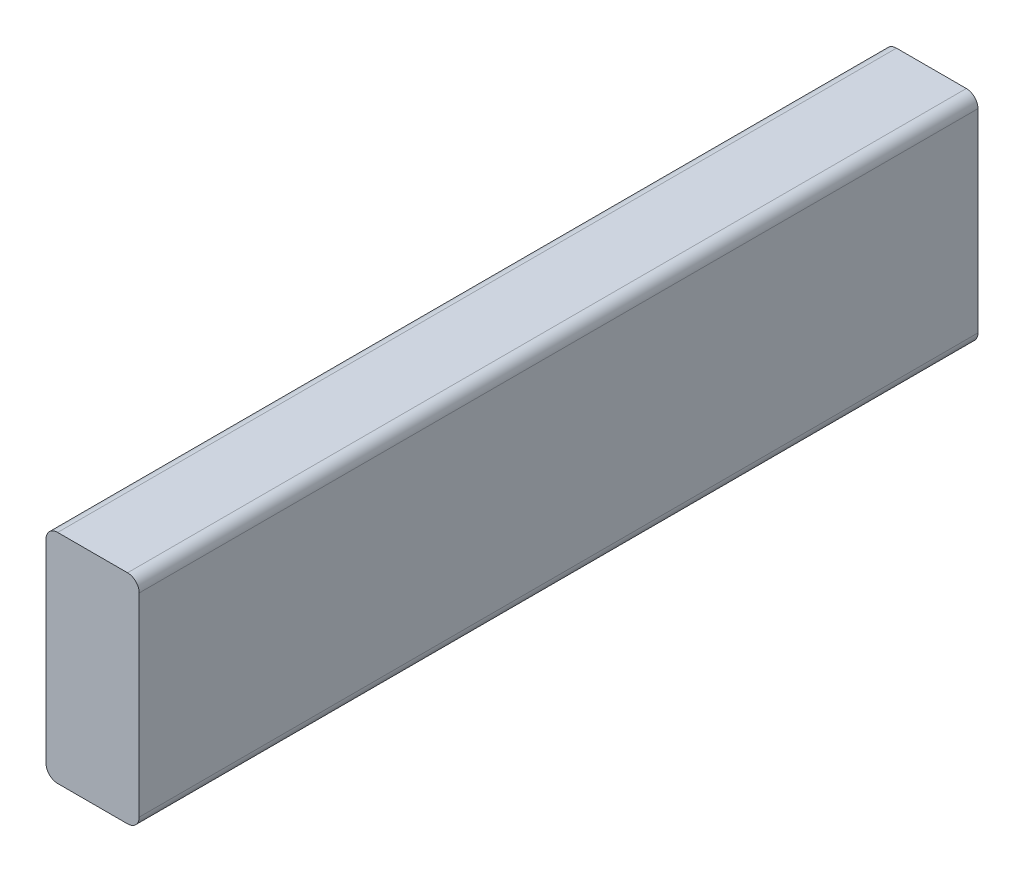
ISO-10303-21;
HEADER;
FILE_DESCRIPTION(('STEP AP214'),'2;1');
FILE_NAME('part.step','',(''),(''),'','','');
FILE_SCHEMA(('AUTOMOTIVE_DESIGN { 1 0 10303 214 1 1 1 1 }'));
ENDSEC;
DATA;
#1=APPLICATION_CONTEXT('core data for automotive mechanical design processes');
#2=APPLICATION_PROTOCOL_DEFINITION('international standard','automotive_design',2000,#1);
#3=PRODUCT_CONTEXT('',#1,'mechanical');
#4=PRODUCT('Part','Part','',(#3));
#5=PRODUCT_RELATED_PRODUCT_CATEGORY('part','',(#4));
#6=PRODUCT_DEFINITION_FORMATION('','',#4);
#7=PRODUCT_DEFINITION_CONTEXT('part definition',#1,'design');
#8=PRODUCT_DEFINITION('design','',#6,#7);
#9=PRODUCT_DEFINITION_SHAPE('','',#8);
#10=(LENGTH_UNIT() NAMED_UNIT(*) SI_UNIT(.MILLI.,.METRE.));
#11=(NAMED_UNIT(*) PLANE_ANGLE_UNIT() SI_UNIT($,.RADIAN.));
#12=(NAMED_UNIT(*) SI_UNIT($,.STERADIAN.) SOLID_ANGLE_UNIT());
#13=UNCERTAINTY_MEASURE_WITH_UNIT(LENGTH_MEASURE(1.E-05),#10,'distance_accuracy_value','');
#14=(GEOMETRIC_REPRESENTATION_CONTEXT(3) GLOBAL_UNCERTAINTY_ASSIGNED_CONTEXT((#13)) GLOBAL_UNIT_ASSIGNED_CONTEXT((#10,
#11,#12)) REPRESENTATION_CONTEXT('',''));
#15=CARTESIAN_POINT('',(0.,0.,0.));
#16=DIRECTION('',(0.,0.,1.));
#17=DIRECTION('',(1.,0.,0.));
#18=AXIS2_PLACEMENT_3D('',#15,#16,#17);
#19=CARTESIAN_POINT('',(0.,0.,-342.9));
#20=DIRECTION('',(0.,0.,-1.));
#21=DIRECTION('',(-1.,0.,0.));
#22=AXIS2_PLACEMENT_3D('',#19,#20,#21);
#23=PLANE('',#22);
#24=DIRECTION('',(0.,1.,0.));
#25=VECTOR('',#24,1.);
#26=CARTESIAN_POINT('',(223.48825000001,1473.2,-342.9));
#27=LINE('',#26,#25);
#28=CARTESIAN_POINT('',(223.48825000001,1389.0625,-342.9));
#29=VERTEX_POINT('',#28);
#30=CARTESIAN_POINT('',(223.48825000001,1468.4375,-342.9));
#31=VERTEX_POINT('',#30);
#32=EDGE_CURVE('E108',#29,#31,#27,.T.);
#33=ORIENTED_EDGE('',*,*,#32,.T.);
#34=CARTESIAN_POINT('',(228.25075000001,1468.4375,-342.9));
#35=DIRECTION('',(0.,0.,-1.));
#36=DIRECTION('',(-1.,0.,0.));
#37=AXIS2_PLACEMENT_3D('',#34,#35,#36);
#38=CIRCLE('',#37,4.7625);
#39=CARTESIAN_POINT('',(228.25075000001,1473.2,-342.9));
#40=VERTEX_POINT('',#39);
#41=EDGE_CURVE('E103',#31,#40,#38,.T.);
#42=ORIENTED_EDGE('',*,*,#41,.T.);
#43=DIRECTION('',(1.,0.,0.));
#44=VECTOR('',#43,1.);
#45=CARTESIAN_POINT('',(261.58825000001,1473.2,-342.9));
#46=LINE('',#45,#44);
#47=CARTESIAN_POINT('',(256.82575000001,1473.2,-342.9));
#48=VERTEX_POINT('',#47);
#49=EDGE_CURVE('E105',#40,#48,#46,.T.);
#50=ORIENTED_EDGE('',*,*,#49,.T.);
#51=CARTESIAN_POINT('',(256.82575000001,1468.4375,-342.9));
#52=DIRECTION('',(0.,0.,-1.));
#53=DIRECTION('',(-1.,0.,0.));
#54=AXIS2_PLACEMENT_3D('',#51,#52,#53);
#55=CIRCLE('',#54,4.7625);
#56=CARTESIAN_POINT('',(261.58825000001,1468.4375,-342.9));
#57=VERTEX_POINT('',#56);
#58=EDGE_CURVE('E155',#48,#57,#55,.T.);
#59=ORIENTED_EDGE('',*,*,#58,.T.);
#60=DIRECTION('',(0.,-1.,0.));
#61=VECTOR('',#60,1.);
#62=CARTESIAN_POINT('',(261.58825000001,1473.2,-342.9));
#63=LINE('',#62,#61);
#64=CARTESIAN_POINT('',(261.58825000001,1389.0625,-342.9));
#65=VERTEX_POINT('',#64);
#66=EDGE_CURVE('E177',#57,#65,#63,.T.);
#67=ORIENTED_EDGE('',*,*,#66,.T.);
#68=CARTESIAN_POINT('',(256.82575000001,1389.0625,-342.9));
#69=DIRECTION('',(0.,0.,-1.));
#70=DIRECTION('',(-1.,0.,0.));
#71=AXIS2_PLACEMENT_3D('',#68,#69,#70);
#72=CIRCLE('',#71,4.7625);
#73=CARTESIAN_POINT('',(256.82575000001,1384.3,-342.9));
#74=VERTEX_POINT('',#73);
#75=EDGE_CURVE('E59',#65,#74,#72,.T.);
#76=ORIENTED_EDGE('',*,*,#75,.T.);
#77=DIRECTION('',(-1.,0.,0.));
#78=VECTOR('',#77,1.);
#79=CARTESIAN_POINT('',(261.58825000001,1384.3,-342.9));
#80=LINE('',#79,#78);
#81=CARTESIAN_POINT('',(228.25075000001,1384.3,-342.9));
#82=VERTEX_POINT('',#81);
#83=EDGE_CURVE('E196',#74,#82,#80,.T.);
#84=ORIENTED_EDGE('',*,*,#83,.T.);
#85=CARTESIAN_POINT('',(228.25075000001,1389.0625,-342.9));
#86=DIRECTION('',(0.,0.,-1.));
#87=DIRECTION('',(-1.,0.,0.));
#88=AXIS2_PLACEMENT_3D('',#85,#86,#87);
#89=CIRCLE('',#88,4.7625);
#90=EDGE_CURVE('E114',#82,#29,#89,.T.);
#91=ORIENTED_EDGE('',*,*,#90,.T.);
#92=EDGE_LOOP('',(#33,#42,#50,#59,#67,#76,#84,#91));
#93=FACE_BOUND('',#92,.T.);
#94=ADVANCED_FACE('F36',(#93),#23,.T.);
#95=CARTESIAN_POINT('',(0.,0.,0.));
#96=DIRECTION('',(0.,0.,1.));
#97=DIRECTION('',(1.,0.,0.));
#98=AXIS2_PLACEMENT_3D('',#95,#96,#97);
#99=PLANE('',#98);
#100=DIRECTION('',(-1.,0.,0.));
#101=VECTOR('',#100,1.);
#102=CARTESIAN_POINT('',(223.48825000001,1473.2,0.));
#103=LINE('',#102,#101);
#104=CARTESIAN_POINT('',(256.82575000001,1473.2,0.));
#105=VERTEX_POINT('',#104);
#106=CARTESIAN_POINT('',(228.25075000001,1473.2,0.));
#107=VERTEX_POINT('',#106);
#108=EDGE_CURVE('E137',#105,#107,#103,.T.);
#109=ORIENTED_EDGE('',*,*,#108,.T.);
#110=CARTESIAN_POINT('',(228.25075000001,1468.4375,0.));
#111=DIRECTION('',(0.,0.,1.));
#112=DIRECTION('',(1.,0.,0.));
#113=AXIS2_PLACEMENT_3D('',#110,#111,#112);
#114=CIRCLE('',#113,4.7625);
#115=CARTESIAN_POINT('',(223.48825000001,1468.4375,0.));
#116=VERTEX_POINT('',#115);
#117=EDGE_CURVE('E128',#107,#116,#114,.T.);
#118=ORIENTED_EDGE('',*,*,#117,.T.);
#119=DIRECTION('',(0.,-1.,0.));
#120=VECTOR('',#119,1.);
#121=CARTESIAN_POINT('',(223.48825000001,1473.2,0.));
#122=LINE('',#121,#120);
#123=CARTESIAN_POINT('',(223.48825000001,1389.0625,0.));
#124=VERTEX_POINT('',#123);
#125=EDGE_CURVE('E125',#116,#124,#122,.T.);
#126=ORIENTED_EDGE('',*,*,#125,.T.);
#127=CARTESIAN_POINT('',(228.25075000001,1389.0625,0.));
#128=DIRECTION('',(0.,0.,1.));
#129=DIRECTION('',(1.,0.,0.));
#130=AXIS2_PLACEMENT_3D('',#127,#128,#129);
#131=CIRCLE('',#130,4.7625);
#132=CARTESIAN_POINT('',(228.25075000001,1384.3,0.));
#133=VERTEX_POINT('',#132);
#134=EDGE_CURVE('E143',#124,#133,#131,.T.);
#135=ORIENTED_EDGE('',*,*,#134,.T.);
#136=DIRECTION('',(1.,0.,0.));
#137=VECTOR('',#136,1.);
#138=CARTESIAN_POINT('',(223.48825000001,1384.3,0.));
#139=LINE('',#138,#137);
#140=CARTESIAN_POINT('',(256.82575000001,1384.3,0.));
#141=VERTEX_POINT('',#140);
#142=EDGE_CURVE('E183',#133,#141,#139,.T.);
#143=ORIENTED_EDGE('',*,*,#142,.T.);
#144=CARTESIAN_POINT('',(256.82575000001,1389.0625,0.));
#145=DIRECTION('',(0.,0.,1.));
#146=DIRECTION('',(1.,0.,0.));
#147=AXIS2_PLACEMENT_3D('',#144,#145,#146);
#148=CIRCLE('',#147,4.7625);
#149=CARTESIAN_POINT('',(261.58825000001,1389.0625,0.));
#150=VERTEX_POINT('',#149);
#151=EDGE_CURVE('E135',#141,#150,#148,.T.);
#152=ORIENTED_EDGE('',*,*,#151,.T.);
#153=DIRECTION('',(0.,1.,0.));
#154=VECTOR('',#153,1.);
#155=CARTESIAN_POINT('',(261.58825000001,1473.2,0.));
#156=LINE('',#155,#154);
#157=CARTESIAN_POINT('',(261.58825000001,1468.4375,0.));
#158=VERTEX_POINT('',#157);
#159=EDGE_CURVE('E175',#150,#158,#156,.T.);
#160=ORIENTED_EDGE('',*,*,#159,.T.);
#161=CARTESIAN_POINT('',(256.82575000001,1468.4375,0.));
#162=DIRECTION('',(0.,0.,1.));
#163=DIRECTION('',(1.,0.,0.));
#164=AXIS2_PLACEMENT_3D('',#161,#162,#163);
#165=CIRCLE('',#164,4.7625);
#166=EDGE_CURVE('E130',#158,#105,#165,.T.);
#167=ORIENTED_EDGE('',*,*,#166,.T.);
#168=EDGE_LOOP('',(#109,#118,#126,#135,#143,#152,#160,#167));
#169=FACE_BOUND('',#168,.T.);
#170=ADVANCED_FACE('F180',(#169),#99,.T.);
#171=CARTESIAN_POINT('',(223.48825000001,1384.3,-439.620318444472));
#172=DIRECTION('',(0.,-1.,0.));
#173=DIRECTION('',(0.,0.,-1.));
#174=AXIS2_PLACEMENT_3D('',#171,#172,#173);
#175=PLANE('',#174);
#176=ORIENTED_EDGE('',*,*,#142,.F.);
#177=DIRECTION('',(0.,0.,1.));
#178=VECTOR('',#177,1.);
#179=CARTESIAN_POINT('',(228.25075000001,1384.3,-439.620318444472));
#180=LINE('',#179,#178);
#181=EDGE_CURVE('E52',#133,#82,#180,.F.);
#182=ORIENTED_EDGE('',*,*,#181,.T.);
#183=ORIENTED_EDGE('',*,*,#83,.F.);
#184=DIRECTION('',(0.,0.,1.));
#185=VECTOR('',#184,1.);
#186=CARTESIAN_POINT('',(256.82575000001,1384.3,-439.620318444472));
#187=LINE('',#186,#185);
#188=EDGE_CURVE('E113',#74,#141,#187,.T.);
#189=ORIENTED_EDGE('',*,*,#188,.T.);
#190=EDGE_LOOP('',(#176,#182,#183,#189));
#191=FACE_BOUND('',#190,.T.);
#192=ADVANCED_FACE('F203',(#191),#175,.T.);
#193=CARTESIAN_POINT('',(261.58825000001,1473.2,-439.620318444472));
#194=DIRECTION('',(1.,0.,0.));
#195=DIRECTION('',(0.,0.,-1.));
#196=AXIS2_PLACEMENT_3D('',#193,#194,#195);
#197=PLANE('',#196);
#198=ORIENTED_EDGE('',*,*,#159,.F.);
#199=DIRECTION('',(0.,0.,1.));
#200=VECTOR('',#199,1.);
#201=CARTESIAN_POINT('',(261.58825000001,1389.0625,-439.620318444472));
#202=LINE('',#201,#200);
#203=EDGE_CURVE('E11',#150,#65,#202,.F.);
#204=ORIENTED_EDGE('',*,*,#203,.T.);
#205=ORIENTED_EDGE('',*,*,#66,.F.);
#206=DIRECTION('',(0.,0.,1.));
#207=VECTOR('',#206,1.);
#208=CARTESIAN_POINT('',(261.58825000001,1468.4375,-439.620318444472));
#209=LINE('',#208,#207);
#210=EDGE_CURVE('E45',#57,#158,#209,.T.);
#211=ORIENTED_EDGE('',*,*,#210,.T.);
#212=EDGE_LOOP('',(#198,#204,#205,#211));
#213=FACE_BOUND('',#212,.T.);
#214=ADVANCED_FACE('F174',(#213),#197,.T.);
#215=CARTESIAN_POINT('',(223.48825000001,1473.2,-439.620318444472));
#216=DIRECTION('',(0.,1.,0.));
#217=DIRECTION('',(0.,0.,1.));
#218=AXIS2_PLACEMENT_3D('',#215,#216,#217);
#219=PLANE('',#218);
#220=ORIENTED_EDGE('',*,*,#49,.F.);
#221=DIRECTION('',(0.,0.,1.));
#222=VECTOR('',#221,1.);
#223=CARTESIAN_POINT('',(228.25075000001,1473.2,-439.620318444472));
#224=LINE('',#223,#222);
#225=EDGE_CURVE('E120',#40,#107,#224,.T.);
#226=ORIENTED_EDGE('',*,*,#225,.T.);
#227=ORIENTED_EDGE('',*,*,#108,.F.);
#228=DIRECTION('',(0.,0.,1.));
#229=VECTOR('',#228,1.);
#230=CARTESIAN_POINT('',(256.82575000001,1473.2,-439.620318444472));
#231=LINE('',#230,#229);
#232=EDGE_CURVE('E123',#105,#48,#231,.F.);
#233=ORIENTED_EDGE('',*,*,#232,.T.);
#234=EDGE_LOOP('',(#220,#226,#227,#233));
#235=FACE_BOUND('',#234,.T.);
#236=ADVANCED_FACE('F118',(#235),#219,.T.);
#237=CARTESIAN_POINT('',(223.48825000001,1473.2,-439.620318444472));
#238=DIRECTION('',(-1.,0.,0.));
#239=DIRECTION('',(0.,0.,1.));
#240=AXIS2_PLACEMENT_3D('',#237,#238,#239);
#241=PLANE('',#240);
#242=ORIENTED_EDGE('',*,*,#125,.F.);
#243=DIRECTION('',(0.,0.,1.));
#244=VECTOR('',#243,1.);
#245=CARTESIAN_POINT('',(223.48825000001,1468.4375,-439.620318444472));
#246=LINE('',#245,#244);
#247=EDGE_CURVE('E152',#116,#31,#246,.F.);
#248=ORIENTED_EDGE('',*,*,#247,.T.);
#249=ORIENTED_EDGE('',*,*,#32,.F.);
#250=DIRECTION('',(0.,0.,1.));
#251=VECTOR('',#250,1.);
#252=CARTESIAN_POINT('',(223.48825000001,1389.0625,-439.620318444472));
#253=LINE('',#252,#251);
#254=EDGE_CURVE('E148',#29,#124,#253,.T.);
#255=ORIENTED_EDGE('',*,*,#254,.T.);
#256=EDGE_LOOP('',(#242,#248,#249,#255));
#257=FACE_BOUND('',#256,.T.);
#258=ADVANCED_FACE('F210',(#257),#241,.T.);
#259=CARTESIAN_POINT('',(228.25075000001,1468.4375,-439.620318444472));
#260=DIRECTION('',(0.,0.,1.));
#261=DIRECTION('',(1.,0.,0.));
#262=AXIS2_PLACEMENT_3D('',#259,#260,#261);
#263=CYLINDRICAL_SURFACE('',#262,4.7625);
#264=ORIENTED_EDGE('',*,*,#41,.F.);
#265=ORIENTED_EDGE('',*,*,#247,.F.);
#266=ORIENTED_EDGE('',*,*,#117,.F.);
#267=ORIENTED_EDGE('',*,*,#225,.F.);
#268=EDGE_LOOP('',(#264,#265,#266,#267));
#269=FACE_BOUND('',#268,.T.);
#270=ADVANCED_FACE('F127',(#269),#263,.T.);
#271=CARTESIAN_POINT('',(228.25075000001,1389.0625,-439.620318444472));
#272=DIRECTION('',(0.,0.,1.));
#273=DIRECTION('',(1.,0.,0.));
#274=AXIS2_PLACEMENT_3D('',#271,#272,#273);
#275=CYLINDRICAL_SURFACE('',#274,4.7625);
#276=ORIENTED_EDGE('',*,*,#90,.F.);
#277=ORIENTED_EDGE('',*,*,#181,.F.);
#278=ORIENTED_EDGE('',*,*,#134,.F.);
#279=ORIENTED_EDGE('',*,*,#254,.F.);
#280=EDGE_LOOP('',(#276,#277,#278,#279));
#281=FACE_BOUND('',#280,.T.);
#282=ADVANCED_FACE('F208',(#281),#275,.T.);
#283=CARTESIAN_POINT('',(256.82575000001,1389.0625,-439.620318444472));
#284=DIRECTION('',(0.,0.,1.));
#285=DIRECTION('',(1.,0.,0.));
#286=AXIS2_PLACEMENT_3D('',#283,#284,#285);
#287=CYLINDRICAL_SURFACE('',#286,4.7625);
#288=ORIENTED_EDGE('',*,*,#75,.F.);
#289=ORIENTED_EDGE('',*,*,#203,.F.);
#290=ORIENTED_EDGE('',*,*,#151,.F.);
#291=ORIENTED_EDGE('',*,*,#188,.F.);
#292=EDGE_LOOP('',(#288,#289,#290,#291));
#293=FACE_BOUND('',#292,.T.);
#294=ADVANCED_FACE('F202',(#293),#287,.T.);
#295=CARTESIAN_POINT('',(256.82575000001,1468.4375,-439.620318444472));
#296=DIRECTION('',(0.,0.,1.));
#297=DIRECTION('',(1.,0.,0.));
#298=AXIS2_PLACEMENT_3D('',#295,#296,#297);
#299=CYLINDRICAL_SURFACE('',#298,4.7625);
#300=ORIENTED_EDGE('',*,*,#58,.F.);
#301=ORIENTED_EDGE('',*,*,#232,.F.);
#302=ORIENTED_EDGE('',*,*,#166,.F.);
#303=ORIENTED_EDGE('',*,*,#210,.F.);
#304=EDGE_LOOP('',(#300,#301,#302,#303));
#305=FACE_BOUND('',#304,.T.);
#306=ADVANCED_FACE('F38',(#305),#299,.T.);
#307=CLOSED_SHELL('',(#94,#170,#192,#214,#236,#258,#270,#282,#294,#306));
#308=MANIFOLD_SOLID_BREP('B2',#307);
#309=ADVANCED_BREP_SHAPE_REPRESENTATION('',(#18,#308),#14);
#310=SHAPE_DEFINITION_REPRESENTATION(#9,#309);
ENDSEC;
END-ISO-10303-21;
